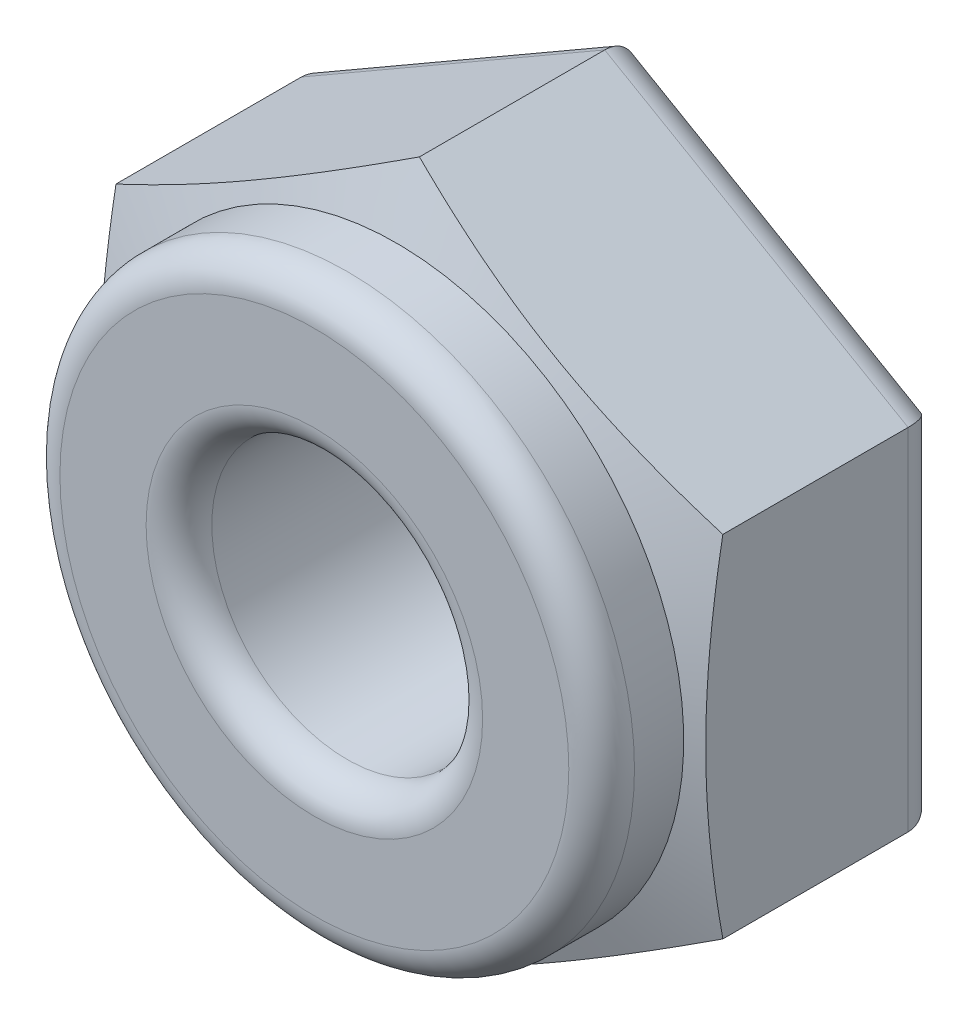
ISO-10303-21;
HEADER;
FILE_DESCRIPTION(('STEP AP214'),'2;1');
FILE_NAME('part.step','',(''),(''),'','','');
FILE_SCHEMA(('AUTOMOTIVE_DESIGN { 1 0 10303 214 1 1 1 1 }'));
ENDSEC;
DATA;
#1=APPLICATION_CONTEXT('core data for automotive mechanical design processes');
#2=APPLICATION_PROTOCOL_DEFINITION('international standard','automotive_design',2000,#1);
#3=PRODUCT_CONTEXT('',#1,'mechanical');
#4=PRODUCT('Part','Part','',(#3));
#5=PRODUCT_RELATED_PRODUCT_CATEGORY('part','',(#4));
#6=PRODUCT_DEFINITION_FORMATION('','',#4);
#7=PRODUCT_DEFINITION_CONTEXT('part definition',#1,'design');
#8=PRODUCT_DEFINITION('design','',#6,#7);
#9=PRODUCT_DEFINITION_SHAPE('','',#8);
#10=(LENGTH_UNIT() NAMED_UNIT(*) SI_UNIT(.MILLI.,.METRE.));
#11=(NAMED_UNIT(*) PLANE_ANGLE_UNIT() SI_UNIT($,.RADIAN.));
#12=(NAMED_UNIT(*) SI_UNIT($,.STERADIAN.) SOLID_ANGLE_UNIT());
#13=UNCERTAINTY_MEASURE_WITH_UNIT(LENGTH_MEASURE(1.E-05),#10,'distance_accuracy_value','');
#14=(GEOMETRIC_REPRESENTATION_CONTEXT(3) GLOBAL_UNCERTAINTY_ASSIGNED_CONTEXT((#13)) GLOBAL_UNIT_ASSIGNED_CONTEXT((#10,
#11,#12)) REPRESENTATION_CONTEXT('',''));
#15=CARTESIAN_POINT('',(0.,0.,0.));
#16=DIRECTION('',(0.,0.,1.));
#17=DIRECTION('',(1.,0.,0.));
#18=AXIS2_PLACEMENT_3D('',#15,#16,#17);
#19=CARTESIAN_POINT('',(0.,-2.33146835171283E-12,4.99999000000044));
#20=DIRECTION('',(0.,0.,-1.));
#21=DIRECTION('',(-1.,0.,0.));
#22=AXIS2_PLACEMENT_3D('',#19,#20,#21);
#23=CYLINDRICAL_SURFACE('',#22,4.44500000000129);
#24=CARTESIAN_POINT('',(2.05391259555748E-12,0.,3.72998999998253));
#25=DIRECTION('',(0.,0.,-1.));
#26=DIRECTION('',(-1.,0.,0.));
#27=AXIS2_PLACEMENT_3D('',#24,#25,#26);
#28=CIRCLE('',#27,4.44499999997766);
#29=CARTESIAN_POINT('',(-4.44499999997561,-1.01666730592746E-13,3.72998999998231));
#30=VERTEX_POINT('',#29);
#31=EDGE_CURVE('E309',#30,#30,#28,.T.);
#32=ORIENTED_EDGE('',*,*,#31,.F.);
#33=EDGE_LOOP('',(#32));
#34=FACE_BOUND('',#33,.T.);
#35=CARTESIAN_POINT('',(3.27515792264421E-12,5.55111512312578E-13,4.49199000000068));
#36=DIRECTION('',(0.,0.,1.));
#37=DIRECTION('',(1.,0.,0.));
#38=AXIS2_PLACEMENT_3D('',#35,#36,#37);
#39=CIRCLE('',#38,4.445);
#40=CARTESIAN_POINT('',(4.44500000000327,7.12289394133546E-13,4.4919900000009));
#41=VERTEX_POINT('',#40);
#42=EDGE_CURVE('E317',#41,#41,#39,.T.);
#43=ORIENTED_EDGE('',*,*,#42,.F.);
#44=EDGE_LOOP('',(#43));
#45=FACE_BOUND('',#44,.T.);
#46=ADVANCED_FACE('F18',(#34,#45),#23,.T.);
#47=CARTESIAN_POINT('',(3.27515792264421E-12,5.55111512312578E-13,4.49199000000068));
#48=DIRECTION('',(0.,0.,1.));
#49=DIRECTION('',(1.,0.,0.));
#50=AXIS2_PLACEMENT_3D('',#47,#48,#49);
#51=TOROIDAL_SURFACE('',#50,3.937,0.508);
#52=ORIENTED_EDGE('',*,*,#42,.T.);
#53=EDGE_LOOP('',(#52));
#54=FACE_BOUND('',#53,.T.);
#55=CARTESIAN_POINT('',(3.25036336734641E-12,5.56549695218678E-13,4.99999000000068));
#56=DIRECTION('',(0.,0.,-1.));
#57=DIRECTION('',(1.,0.,0.));
#58=AXIS2_PLACEMENT_3D('',#55,#56,#57);
#59=CIRCLE('',#58,3.93699999999893);
#60=CARTESIAN_POINT('',(-3.93699999999797,-1.00423854415712E-13,4.99999000000046));
#61=VERTEX_POINT('',#60);
#62=CARTESIAN_POINT('',(3.93700000000229,-4.59442828226769E-13,4.99999000000071));
#63=VERTEX_POINT('',#62);
#64=EDGE_CURVE('E124',#61,#63,#59,.F.);
#65=ORIENTED_EDGE('',*,*,#64,.F.);
#66=CARTESIAN_POINT('',(3.25036336734641E-12,5.56549695218678E-13,4.99999000000068));
#67=DIRECTION('',(0.,0.,-1.));
#68=DIRECTION('',(-1.,-6.84496563455178E-13,0.));
#69=AXIS2_PLACEMENT_3D('',#66,#67,#68);
#70=CIRCLE('',#69,3.93700000000164);
#71=EDGE_CURVE('E97',#63,#61,#70,.F.);
#72=ORIENTED_EDGE('',*,*,#71,.F.);
#73=EDGE_LOOP('',(#65,#72));
#74=FACE_BOUND('',#73,.T.);
#75=ADVANCED_FACE('F164',(#54,#74),#51,.T.);
#76=CARTESIAN_POINT('',(2.07125983031631E-12,0.,3.37250682844141));
#77=DIRECTION('',(0.,0.,-1.));
#78=DIRECTION('',(-1.,0.,0.));
#79=AXIS2_PLACEMENT_3D('',#76,#77,#78);
#80=CONICAL_SURFACE('',#79,5.42717694168212,1.22173047640878);
#81=CARTESIAN_POINT('',(9.77358803696029E-13,-5.42131902769296,3.37463893476826));
#82=CARTESIAN_POINT('',(0.194430301529192,-5.30906464076703,3.41550962808794));
#83=CARTESIAN_POINT('',(0.389501710334746,-5.19644011038195,3.45268845797098));
#84=CARTESIAN_POINT('',(0.78091278213935,-4.97045882271176,3.51809868629432));
#85=CARTESIAN_POINT('',(0.977253315522419,-4.85710156291021,3.54632308473285));
#86=CARTESIAN_POINT('',(1.36902392099205,-4.63091269838175,3.59197517919712));
#87=CARTESIAN_POINT('',(1.56444504779045,-4.51808625821935,3.60950244014097));
#88=CARTESIAN_POINT('',(1.95574424899372,-4.29216955907096,3.63301140707363));
#89=CARTESIAN_POINT('',(2.15162212449736,-4.17907941492065,3.63899744141869));
#90=CARTESIAN_POINT('',(2.54337787550463,-3.95289912662001,3.63899744141878));
#91=CARTESIAN_POINT('',(2.73925575100827,-3.8398089824697,3.63301140707382));
#92=CARTESIAN_POINT('',(3.13055495221155,-3.6138922833213,3.60950244014134));
#93=CARTESIAN_POINT('',(3.32597607900996,-3.5010658431589,3.59197517919758));
#94=CARTESIAN_POINT('',(3.71774668447961,-3.27487697863042,3.54632308473346));
#95=CARTESIAN_POINT('',(3.91408721786269,-3.16151971882887,3.51809868629502));
#96=CARTESIAN_POINT('',(4.30549828966731,-2.93553843115867,3.45268845797182));
#97=CARTESIAN_POINT('',(4.50056969847288,-2.82291390077358,3.41550962808885));
#98=CARTESIAN_POINT('',(4.6950000000011,-2.71065951384764,3.37463893476924));
#99=B_SPLINE_CURVE_WITH_KNOTS('',3,(#81,#82,#83,#84,#85,#86,#87,#88,#89,#90,#91,#92,#93,#94,#95,
#96,#97,#98),.UNSPECIFIED.,.F.,.F.,(4,2,2,2,2,2,2,2,4),(0.,0.684666414959032,1.36986674698595,
2.04858815775574,2.72705497514132,3.40552179252691,4.0842432032967,4.76944353532362,
5.45410995028266),.UNSPECIFIED.);
#100=CARTESIAN_POINT('',(0.,-5.42131902769253,3.37463893476842));
#101=VERTEX_POINT('',#100);
#102=CARTESIAN_POINT('',(4.69500000000178,-2.71065951384683,3.37463893476917));
#103=VERTEX_POINT('',#102);
#104=EDGE_CURVE('E179',#101,#103,#99,.T.);
#105=ORIENTED_EDGE('',*,*,#104,.T.);
#106=CARTESIAN_POINT('',(4.69500000000245,-2.71065951384603,3.37463893476911));
#107=CARTESIAN_POINT('',(4.69500000000286,-2.48615073999411,3.41550962808906));
#108=CARTESIAN_POINT('',(4.69500000000266,-2.26090167922388,3.45268845797194));
#109=CARTESIAN_POINT('',(4.69500000000226,-1.80893910388352,3.51809868629495));
#110=CARTESIAN_POINT('',(4.69500000000206,-1.58222458428049,3.5463230847333));
#111=CARTESIAN_POINT('',(4.69500000000288,-1.12984685522358,3.59197517919809));
#112=CARTESIAN_POINT('',(4.69500000000389,-0.904193974898762,3.60950244014261));
#113=CARTESIAN_POINT('',(4.69500000000107,-0.452360576601816,3.63301140707324));
#114=CARTESIAN_POINT('',(4.69499999999725,-0.226180288301049,3.63899744141559));
#115=CARTESIAN_POINT('',(4.69499999999726,0.226180288300474,3.6389974414156));
#116=CARTESIAN_POINT('',(4.69500000000109,0.452360576601231,3.63301140707326));
#117=CARTESIAN_POINT('',(4.69500000000391,0.904193974898157,3.60950244014265));
#118=CARTESIAN_POINT('',(4.69500000000291,1.12984685522297,3.59197517919813));
#119=CARTESIAN_POINT('',(4.69500000000211,1.58222458427985,3.54632308473336));
#120=CARTESIAN_POINT('',(4.69500000000231,1.80893910388288,3.51809868629502));
#121=CARTESIAN_POINT('',(4.69500000000273,2.26090167922322,3.45268845797203));
#122=CARTESIAN_POINT('',(4.69500000000294,2.48615073999344,3.41550962808916));
#123=CARTESIAN_POINT('',(4.69500000000253,2.71065951384535,3.37463893476921));
#124=B_SPLINE_CURVE_WITH_KNOTS('',3,(#106,#107,#108,#109,#110,#111,#112,#113,#114,#115,#116,
#117,#118,#119,#120,#121,#122,#123),.UNSPECIFIED.,.F.,.F.,(4,2,2,2,2,2,2,2,4),(0.,
0.684666414959181,1.36986674698589,2.04858815775578,2.72705497514164,3.40552179252747,
4.08424320329733,4.769443535324,5.45410995028315),.UNSPECIFIED.);
#125=CARTESIAN_POINT('',(4.69500000000157,2.71065951384619,3.37463893476936));
#126=VERTEX_POINT('',#125);
#127=EDGE_CURVE('E171',#103,#126,#124,.T.);
#128=ORIENTED_EDGE('',*,*,#127,.T.);
#129=CARTESIAN_POINT('',(4.6950000000006,2.71065951384703,3.37463893476952));
#130=CARTESIAN_POINT('',(4.5005696984724,2.82291390077294,3.41550962808913));
#131=CARTESIAN_POINT('',(4.30549828966687,2.935538431158,3.4526884579721));
#132=CARTESIAN_POINT('',(3.91408721786231,3.16151971882813,3.5180986862953));
#133=CARTESIAN_POINT('',(3.71774668447926,3.27487697862966,3.54632308473375));
#134=CARTESIAN_POINT('',(3.32597607900968,3.50106584315808,3.59197517919787));
#135=CARTESIAN_POINT('',(3.1305549522113,3.61389228332045,3.60950244014164));
#136=CARTESIAN_POINT('',(2.73925575100808,3.83980898246878,3.63301140707414));
#137=CARTESIAN_POINT('',(2.54337787550448,3.95289912661907,3.63899744141911));
#138=CARTESIAN_POINT('',(2.15162212449726,4.17907941491964,3.63899744141904));
#139=CARTESIAN_POINT('',(1.95574424899366,4.29216955906993,3.63301140707399));
#140=CARTESIAN_POINT('',(1.56444504779045,4.51808625821826,3.60950244014136));
#141=CARTESIAN_POINT('',(1.36902392099208,4.63091269838063,3.59197517919752));
#142=CARTESIAN_POINT('',(0.977253315522507,4.85710156290904,3.54632308473327));
#143=CARTESIAN_POINT('',(0.780912782139468,4.97045882271056,3.51809868629476));
#144=CARTESIAN_POINT('',(0.389501710334925,5.19644011038069,3.45268845797144));
#145=CARTESIAN_POINT('',(0.1944303015294,5.30906464076575,3.41550962808841));
#146=CARTESIAN_POINT('',(1.21646039087442E-12,5.42131902769166,3.37463893476875));
#147=B_SPLINE_CURVE_WITH_KNOTS('',3,(#129,#130,#131,#132,#133,#134,#135,#136,#137,#138,#139,
#140,#141,#142,#143,#144,#145,#146),.UNSPECIFIED.,.F.,.F.,(4,2,2,2,2,2,2,2,4),(0.,
0.684666414958911,1.36986674698571,2.04858815775538,2.72705497514084,3.4055217925263,
4.08424320329596,4.76944353532276,5.45410995028166),.UNSPECIFIED.);
#148=CARTESIAN_POINT('',(0.,5.42131902769152,3.3746389347688));
#149=VERTEX_POINT('',#148);
#150=EDGE_CURVE('E138',#126,#149,#147,.T.);
#151=ORIENTED_EDGE('',*,*,#150,.T.);
#152=CARTESIAN_POINT('',(-1.13361914529046E-12,5.42131902769138,3.37463893476885));
#153=CARTESIAN_POINT('',(-0.194430301529269,5.3090646407655,3.41550962808843));
#154=CARTESIAN_POINT('',(-0.389501710334744,5.19644011038046,3.45268845797138));
#155=CARTESIAN_POINT('',(-0.780912782139187,4.97045882271036,3.51809868629453));
#156=CARTESIAN_POINT('',(-0.977253315522173,4.85710156290886,3.54632308473297));
#157=CARTESIAN_POINT('',(-1.36902392099164,4.63091269838049,3.59197517919706));
#158=CARTESIAN_POINT('',(-1.56444504778996,4.51808625821814,3.60950244014081));
#159=CARTESIAN_POINT('',(-1.95574424899306,4.29216955906985,3.6330114070733));
#160=CARTESIAN_POINT('',(-2.15162212449661,4.17907941491959,3.63899744141827));
#161=CARTESIAN_POINT('',(-2.5433778755037,3.95289912661906,3.63899744141821));
#162=CARTESIAN_POINT('',(-2.73925575100725,3.8398089824688,3.63301140707317));
#163=CARTESIAN_POINT('',(-3.13055495221034,3.61389228332051,3.60950244014056));
#164=CARTESIAN_POINT('',(-3.32597607900866,3.50106584315816,3.59197517919675));
#165=CARTESIAN_POINT('',(-3.71774668447811,3.2748769786298,3.54632308473254));
#166=CARTESIAN_POINT('',(-3.91408721786109,3.1615197188283,3.51809868629405));
#167=CARTESIAN_POINT('',(-4.30549828966552,2.93553843115822,3.45268845797079));
#168=CARTESIAN_POINT('',(-4.50056969847099,2.82291390077318,3.4155096280878));
#169=CARTESIAN_POINT('',(-4.69499999999912,2.7106595138473,3.37463893476817));
#170=B_SPLINE_CURVE_WITH_KNOTS('',3,(#152,#153,#154,#155,#156,#157,#158,#159,#160,#161,#162,
#163,#164,#165,#166,#167,#168,#169),.UNSPECIFIED.,.F.,.F.,(4,2,2,2,2,2,2,2,4),(0.,
0.684666414958716,1.36986674698532,2.0485881577548,2.72705497514007,3.40552179252535,
4.08424320329483,4.76944353532142,5.45410995028014),.UNSPECIFIED.);
#171=CARTESIAN_POINT('',(-4.69499999999989,2.71065951384587,3.37463893476818));
#172=VERTEX_POINT('',#171);
#173=EDGE_CURVE('E129',#149,#172,#170,.T.);
#174=ORIENTED_EDGE('',*,*,#173,.T.);
#175=CARTESIAN_POINT('',(-4.69500000000013,2.71065951384475,3.37463893476831));
#176=CARTESIAN_POINT('',(-4.69500000000072,2.48615073999291,3.41550962808835));
#177=CARTESIAN_POINT('',(-4.69500000000043,2.26090167922275,3.45268845797113));
#178=CARTESIAN_POINT('',(-4.69499999999985,1.80893910388258,3.51809868629394));
#179=CARTESIAN_POINT('',(-4.69499999999956,1.58222458427967,3.54632308473219));
#180=CARTESIAN_POINT('',(-4.69500000000073,1.12984685522298,3.59197517919717));
#181=CARTESIAN_POINT('',(-4.69500000000217,0.904193974898241,3.60950244014197));
#182=CARTESIAN_POINT('',(-4.69499999999815,0.452360576601415,3.63301140707172));
#183=CARTESIAN_POINT('',(-4.69499999999268,0.226180288300685,3.63899744141291));
#184=CARTESIAN_POINT('',(-4.69499999999268,-0.226180288301027,3.6389974414129));
#185=CARTESIAN_POINT('',(-4.69499999999816,-0.45236057660201,3.6330114070717));
#186=CARTESIAN_POINT('',(-4.6950000000022,-0.904193974899341,3.60950244014189));
#187=CARTESIAN_POINT('',(-4.69500000000077,-1.12984685522433,3.59197517919704));
#188=CARTESIAN_POINT('',(-4.69499999999961,-1.58222458428153,3.54632308473196));
#189=CARTESIAN_POINT('',(-4.69499999999991,-1.80893910388469,3.51809868629364));
#190=CARTESIAN_POINT('',(-4.69500000000049,-2.26090167922536,3.4526884579707));
#191=CARTESIAN_POINT('',(-4.69500000000079,-2.48615073999577,3.41550962808784));
#192=CARTESIAN_POINT('',(-4.69500000000021,-2.71065951384786,3.37463893476772));
#193=B_SPLINE_CURVE_WITH_KNOTS('',3,(#175,#176,#177,#178,#179,#180,#181,#182,#183,#184,#185,
#186,#187,#188,#189,#190,#191,#192),.UNSPECIFIED.,.F.,.F.,(4,2,2,2,2,2,2,2,4),(0.,
0.684666414958953,1.36986674698527,2.04858815775493,2.72705497514062,3.40552179252708,
4.08424320329749,4.76944353532459,5.45410995028431),.UNSPECIFIED.);
#194=CARTESIAN_POINT('',(-4.69499999999892,-2.71065951384842,3.37463893476802));
#195=VERTEX_POINT('',#194);
#196=EDGE_CURVE('E115',#172,#195,#193,.T.);
#197=ORIENTED_EDGE('',*,*,#196,.T.);
#198=CARTESIAN_POINT('',(-4.69499999999763,-2.71065951384898,3.37463893476833));
#199=CARTESIAN_POINT('',(-4.50056969846956,-2.82291390077483,3.41550962808792));
#200=CARTESIAN_POINT('',(-4.30549828966414,-2.93553843115982,3.45268845797087));
#201=CARTESIAN_POINT('',(-3.91408721785981,-3.16151971882983,3.51809868629406));
#202=CARTESIAN_POINT('',(-3.71774668447689,-3.27487697863128,3.54632308473251));
#203=CARTESIAN_POINT('',(-3.32597607900754,-3.50106584315957,3.59197517919664));
#204=CARTESIAN_POINT('',(-3.13055495220927,-3.61389228332188,3.60950244014043));
#205=CARTESIAN_POINT('',(-2.73925575100629,-3.83980898247009,3.63301140707298));
#206=CARTESIAN_POINT('',(-2.54337787550279,-3.95289912662031,3.63899744141799));
#207=CARTESIAN_POINT('',(-2.1516221244958,-4.17907941492075,3.63899744141801));
#208=CARTESIAN_POINT('',(-1.95574424899231,-4.29216955907098,3.63301140707302));
#209=CARTESIAN_POINT('',(-1.56444504778931,-4.51808625821919,3.60950244014052));
#210=CARTESIAN_POINT('',(-1.36902392099105,-4.63091269838149,3.59197517919675));
#211=CARTESIAN_POINT('',(-0.977253315521696,-4.85710156290978,3.54632308473266));
#212=CARTESIAN_POINT('',(-0.780912782138766,-4.97045882271124,3.51809868629423));
#213=CARTESIAN_POINT('',(-0.389501710334434,-5.19644011038125,3.45268845797109));
#214=CARTESIAN_POINT('',(-0.194430301529014,-5.30906464076624,3.41550962808815));
#215=CARTESIAN_POINT('',(-9.32374946167448E-13,-5.42131902769209,3.37463893476858));
#216=B_SPLINE_CURVE_WITH_KNOTS('',3,(#198,#199,#200,#201,#202,#203,#204,#205,#206,#207,#208,
#209,#210,#211,#212,#213,#214,#215),.UNSPECIFIED.,.F.,.F.,(4,2,2,2,2,2,2,2,4),(0.,
0.684666414958509,1.3698667469849,2.04858815775418,2.72705497513925,3.40552179252433,
4.0842432032936,4.76944353532,5.45410995027851),.UNSPECIFIED.);
#217=EDGE_CURVE('E90',#195,#101,#216,.T.);
#218=ORIENTED_EDGE('',*,*,#217,.T.);
#219=EDGE_LOOP('',(#105,#128,#151,#174,#197,#218));
#220=FACE_BOUND('',#219,.T.);
#221=ORIENTED_EDGE('',*,*,#31,.T.);
#222=EDGE_LOOP('',(#221));
#223=FACE_BOUND('',#222,.T.);
#224=ADVANCED_FACE('F135',(#220,#223),#80,.T.);
#225=CARTESIAN_POINT('',(0.,-2.33146835171283E-12,4.99999000000044));
#226=DIRECTION('',(0.,0.,1.));
#227=DIRECTION('',(1.,0.,0.));
#228=AXIS2_PLACEMENT_3D('',#225,#226,#227);
#229=PLANE('',#228);
#230=ORIENTED_EDGE('',*,*,#71,.T.);
#231=ORIENTED_EDGE('',*,*,#64,.T.);
#232=EDGE_LOOP('',(#230,#231));
#233=FACE_BOUND('',#232,.T.);
#234=CARTESIAN_POINT('',(3.25036336734641E-12,5.56549695218678E-13,4.99999000000068));
#235=DIRECTION('',(0.,0.,1.));
#236=DIRECTION('',(-1.,-2.96362594046223E-13,0.));
#237=AXIS2_PLACEMENT_3D('',#234,#235,#236);
#238=CIRCLE('',#237,2.6035000000024);
#239=CARTESIAN_POINT('',(-2.60349999999792,3.28839697309287E-13,4.9999900000005));
#240=VERTEX_POINT('',#239);
#241=CARTESIAN_POINT('',(2.60350000000311,6.48611025999525E-13,4.99999000000067));
#242=VERTEX_POINT('',#241);
#243=EDGE_CURVE('E108',#240,#242,#238,.T.);
#244=ORIENTED_EDGE('',*,*,#243,.F.);
#245=CARTESIAN_POINT('',(3.25036336734641E-12,5.56549695218678E-13,4.99999000000068));
#246=DIRECTION('',(0.,0.,1.));
#247=DIRECTION('',(1.,0.,0.));
#248=AXIS2_PLACEMENT_3D('',#245,#246,#247);
#249=CIRCLE('',#248,2.60349999999911);
#250=EDGE_CURVE('E269',#242,#240,#249,.T.);
#251=ORIENTED_EDGE('',*,*,#250,.F.);
#252=EDGE_LOOP('',(#244,#251));
#253=FACE_BOUND('',#252,.T.);
#254=ADVANCED_FACE('F163',(#233,#253),#229,.T.);
#255=CARTESIAN_POINT('',(-4.69500000000013,2.71065951384336,3.72999000000336));
#256=DIRECTION('',(1.,0.,0.));
#257=DIRECTION('',(0.,1.,0.));
#258=AXIS2_PLACEMENT_3D('',#255,#256,#257);
#259=PLANE('',#258);
#260=DIRECTION('',(0.,-1.,0.));
#261=VECTOR('',#260,1.);
#262=CARTESIAN_POINT('',(-4.6949999999991,2.71065951384431,0.507999999999532));
#263=LINE('',#262,#261);
#264=CARTESIAN_POINT('',(-4.69500000000056,-2.71065951384784,0.508000000000503));
#265=VERTEX_POINT('',#264);
#266=CARTESIAN_POINT('',(-4.69499999999922,2.71065951384664,0.50800000000146));
#267=VERTEX_POINT('',#266);
#268=EDGE_CURVE('E249',#265,#267,#263,.F.);
#269=ORIENTED_EDGE('',*,*,#268,.F.);
#270=DIRECTION('',(0.,0.,1.));
#271=VECTOR('',#270,1.);
#272=CARTESIAN_POINT('',(-4.69500000000179,-2.71065951384659,3.72999000000096));
#273=LINE('',#272,#271);
#274=EDGE_CURVE('E121',#265,#195,#273,.T.);
#275=ORIENTED_EDGE('',*,*,#274,.T.);
#276=ORIENTED_EDGE('',*,*,#196,.F.);
#277=DIRECTION('',(0.,0.,1.));
#278=VECTOR('',#277,1.);
#279=CARTESIAN_POINT('',(-4.69499999999965,2.71065951384699,3.72999000000243));
#280=LINE('',#279,#278);
#281=EDGE_CURVE('E119',#172,#267,#280,.F.);
#282=ORIENTED_EDGE('',*,*,#281,.T.);
#283=EDGE_LOOP('',(#269,#275,#276,#282));
#284=FACE_BOUND('',#283,.T.);
#285=ADVANCED_FACE('F118',(#284),#259,.F.);
#286=CARTESIAN_POINT('',(-4.69499999999978,-2.71065951384775,3.72999000000096));
#287=DIRECTION('',(0.499999999999961,0.866025403784461,0.));
#288=DIRECTION('',(-0.866025403784461,0.499999999999961,0.));
#289=AXIS2_PLACEMENT_3D('',#286,#287,#288);
#290=PLANE('',#289);
#291=DIRECTION('',(0.866025403784461,-0.499999999999961,0.));
#292=VECTOR('',#291,1.);
#293=CARTESIAN_POINT('',(-4.69499999999997,-2.71065951384837,0.508000000001552));
#294=LINE('',#293,#292);
#295=CARTESIAN_POINT('',(-2.39601704739313E-12,-5.42131902769317,0.507999999999756));
#296=VERTEX_POINT('',#295);
#297=EDGE_CURVE('E332',#296,#265,#294,.F.);
#298=ORIENTED_EDGE('',*,*,#297,.F.);
#299=DIRECTION('',(0.,0.,1.));
#300=VECTOR('',#299,1.);
#301=CARTESIAN_POINT('',(-2.43217106879337E-12,-5.42131902769494,3.72999000000234));
#302=LINE('',#301,#300);
#303=EDGE_CURVE('E255',#296,#101,#302,.T.);
#304=ORIENTED_EDGE('',*,*,#303,.T.);
#305=ORIENTED_EDGE('',*,*,#217,.F.);
#306=ORIENTED_EDGE('',*,*,#274,.F.);
#307=EDGE_LOOP('',(#298,#304,#305,#306));
#308=FACE_BOUND('',#307,.T.);
#309=ADVANCED_FACE('F193',(#308),#290,.F.);
#310=CARTESIAN_POINT('',(-4.16333634234434E-13,-5.42131902769377,3.72999000000234));
#311=DIRECTION('',(-0.499999999999995,0.866025403784442,0.));
#312=DIRECTION('',(-0.866025403784442,-0.499999999999995,0.));
#313=AXIS2_PLACEMENT_3D('',#310,#311,#312);
#314=PLANE('',#313);
#315=DIRECTION('',(0.866025403784442,0.499999999999995,0.));
#316=VECTOR('',#315,1.);
#317=CARTESIAN_POINT('',(-1.06094603588569E-12,-5.42131902769181,0.507999999997941));
#318=LINE('',#317,#316);
#319=CARTESIAN_POINT('',(4.69500000000172,-2.7106595138457,0.507999999999468));
#320=VERTEX_POINT('',#319);
#321=EDGE_CURVE('E330',#320,#296,#318,.F.);
#322=ORIENTED_EDGE('',*,*,#321,.F.);
#323=DIRECTION('',(0.,0.,1.));
#324=VECTOR('',#323,1.);
#325=CARTESIAN_POINT('',(4.69500000000245,-2.7106595138463,3.72999000000097));
#326=LINE('',#325,#324);
#327=EDGE_CURVE('E252',#320,#103,#326,.T.);
#328=ORIENTED_EDGE('',*,*,#327,.T.);
#329=ORIENTED_EDGE('',*,*,#104,.F.);
#330=ORIENTED_EDGE('',*,*,#303,.F.);
#331=EDGE_LOOP('',(#322,#328,#329,#330));
#332=FACE_BOUND('',#331,.T.);
#333=ADVANCED_FACE('F196',(#332),#314,.F.);
#334=CARTESIAN_POINT('',(4.69500000000245,-2.71065951384664,3.72999000000097));
#335=DIRECTION('',(-1.,0.,0.));
#336=DIRECTION('',(0.,-1.,0.));
#337=AXIS2_PLACEMENT_3D('',#334,#335,#336);
#338=PLANE('',#337);
#339=DIRECTION('',(0.,1.,0.));
#340=VECTOR('',#339,1.);
#341=CARTESIAN_POINT('',(4.69500000000149,-2.71065951384814,0.508000000000926));
#342=LINE('',#341,#340);
#343=CARTESIAN_POINT('',(4.69500000000079,2.71065951384702,0.508000000000082));
#344=VERTEX_POINT('',#343);
#345=EDGE_CURVE('E328',#344,#320,#342,.F.);
#346=ORIENTED_EDGE('',*,*,#345,.F.);
#347=DIRECTION('',(0.,0.,1.));
#348=VECTOR('',#347,1.);
#349=CARTESIAN_POINT('',(4.69499999999997,2.71065951384738,3.72999000000281));
#350=LINE('',#349,#348);
#351=EDGE_CURVE('E140',#344,#126,#350,.T.);
#352=ORIENTED_EDGE('',*,*,#351,.T.);
#353=ORIENTED_EDGE('',*,*,#127,.F.);
#354=ORIENTED_EDGE('',*,*,#327,.F.);
#355=EDGE_LOOP('',(#346,#352,#353,#354));
#356=FACE_BOUND('',#355,.T.);
#357=ADVANCED_FACE('F378',(#356),#338,.F.);
#358=CARTESIAN_POINT('',(4.69500000000203,2.71065951384619,3.72999000000281));
#359=DIRECTION('',(-0.499999999999958,-0.866025403784463,0.));
#360=DIRECTION('',(0.866025403784463,-0.499999999999958,0.));
#361=AXIS2_PLACEMENT_3D('',#358,#359,#360);
#362=PLANE('',#361);
#363=DIRECTION('',(-0.866025403784463,0.499999999999958,0.));
#364=VECTOR('',#363,1.);
#365=CARTESIAN_POINT('',(4.6950000000031,2.71065951384571,0.508000000000939));
#366=LINE('',#365,#364);
#367=CARTESIAN_POINT('',(2.33156549587219E-13,5.4213190276914,0.508000000002197));
#368=VERTEX_POINT('',#367);
#369=EDGE_CURVE('E325',#368,#344,#366,.F.);
#370=ORIENTED_EDGE('',*,*,#369,.F.);
#371=DIRECTION('',(0.,0.,1.));
#372=VECTOR('',#371,1.);
#373=CARTESIAN_POINT('',(-1.02637347679685E-12,5.42131902769144,3.72999000000243));
#374=LINE('',#373,#372);
#375=EDGE_CURVE('E132',#368,#149,#374,.T.);
#376=ORIENTED_EDGE('',*,*,#375,.T.);
#377=ORIENTED_EDGE('',*,*,#150,.F.);
#378=ORIENTED_EDGE('',*,*,#351,.F.);
#379=EDGE_LOOP('',(#370,#376,#377,#378));
#380=FACE_BOUND('',#379,.T.);
#381=ADVANCED_FACE('F368',(#380),#362,.F.);
#382=CARTESIAN_POINT('',(0.,5.42131902769205,3.72999000000243));
#383=DIRECTION('',(0.499999999999994,-0.866025403784442,0.));
#384=DIRECTION('',(0.866025403784442,0.499999999999994,0.));
#385=AXIS2_PLACEMENT_3D('',#382,#383,#384);
#386=PLANE('',#385);
#387=DIRECTION('',(-0.866025403784442,-0.499999999999994,0.));
#388=VECTOR('',#387,1.);
#389=CARTESIAN_POINT('',(1.75532331725403E-13,5.42131902769108,0.508000000003442));
#390=LINE('',#389,#388);
#391=EDGE_CURVE('E131',#267,#368,#390,.F.);
#392=ORIENTED_EDGE('',*,*,#391,.F.);
#393=ORIENTED_EDGE('',*,*,#281,.F.);
#394=ORIENTED_EDGE('',*,*,#173,.F.);
#395=ORIENTED_EDGE('',*,*,#375,.F.);
#396=EDGE_LOOP('',(#392,#393,#394,#395));
#397=FACE_BOUND('',#396,.T.);
#398=ADVANCED_FACE('F127',(#397),#386,.F.);
#399=CARTESIAN_POINT('',(3.27515792264421E-12,5.55111512312578E-13,4.49199000000068));
#400=DIRECTION('',(0.,0.,1.));
#401=DIRECTION('',(1.,0.,0.));
#402=AXIS2_PLACEMENT_3D('',#399,#400,#401);
#403=TOROIDAL_SURFACE('',#402,2.6035,0.508);
#404=CARTESIAN_POINT('',(-2.19245855220889E-13,0.,4.49199000000068));
#405=DIRECTION('',(0.,0.,1.));
#406=DIRECTION('',(1.,0.,0.));
#407=AXIS2_PLACEMENT_3D('',#404,#405,#406);
#408=CIRCLE('',#407,2.09550000000061);
#409=CARTESIAN_POINT('',(2.09550000000039,0.,4.49199000000078));
#410=VERTEX_POINT('',#409);
#411=EDGE_CURVE('E321',#410,#410,#408,.F.);
#412=ORIENTED_EDGE('',*,*,#411,.T.);
#413=EDGE_LOOP('',(#412));
#414=FACE_BOUND('',#413,.T.);
#415=ORIENTED_EDGE('',*,*,#250,.T.);
#416=ORIENTED_EDGE('',*,*,#243,.T.);
#417=EDGE_LOOP('',(#415,#416));
#418=FACE_BOUND('',#417,.T.);
#419=ADVANCED_FACE('F238',(#414,#418),#403,.T.);
#420=CARTESIAN_POINT('',(-4.18699999999896,2.7106595138443,0.508000000001778));
#421=DIRECTION('',(0.,-1.,0.));
#422=DIRECTION('',(1.,0.,0.));
#423=AXIS2_PLACEMENT_3D('',#420,#421,#422);
#424=CYLINDRICAL_SURFACE('',#423,0.508000000000145);
#425=CARTESIAN_POINT('',(-4.18699999999896,2.41736557709788,0.508000000002062));
#426=DIRECTION('',(-0.50000000000001,-0.866025403784433,0.));
#427=DIRECTION('',(-0.866025403784433,0.50000000000001,0.));
#428=AXIS2_PLACEMENT_3D('',#425,#426,#427);
#429=ELLIPSE('',#428,0.586587873496804,0.508000000000126);
#430=CARTESIAN_POINT('',(-4.18699999999525,2.4173655770949,2.27930635064891E-13));
#431=VERTEX_POINT('',#430);
#432=EDGE_CURVE('E322',#431,#267,#429,.F.);
#433=ORIENTED_EDGE('',*,*,#432,.F.);
#434=DIRECTION('',(0.,1.,0.));
#435=VECTOR('',#434,1.);
#436=CARTESIAN_POINT('',(-4.18699999999597,-5.42131902769305,2.50153828207419E-13));
#437=LINE('',#436,#435);
#438=CARTESIAN_POINT('',(-4.18699999999677,-2.41736557709909,2.41668664247019E-13));
#439=VERTEX_POINT('',#438);
#440=EDGE_CURVE('E345',#431,#439,#437,.F.);
#441=ORIENTED_EDGE('',*,*,#440,.T.);
#442=CARTESIAN_POINT('',(-4.18699999999903,-2.4173655771004,0.508000000000943));
#443=DIRECTION('',(0.500000000000013,-0.866025403784431,0.));
#444=DIRECTION('',(0.866025403784431,0.500000000000013,0.));
#445=AXIS2_PLACEMENT_3D('',#442,#443,#444);
#446=ELLIPSE('',#445,0.586587873496836,0.508000000000144);
#447=EDGE_CURVE('E151',#265,#439,#446,.T.);
#448=ORIENTED_EDGE('',*,*,#447,.F.);
#449=ORIENTED_EDGE('',*,*,#268,.T.);
#450=EDGE_LOOP('',(#433,#441,#448,#449));
#451=FACE_BOUND('',#450,.T.);
#452=ADVANCED_FACE('F235',(#451),#424,.T.);
#453=CARTESIAN_POINT('',(-4.44099999999992,-2.27071860872574,0.508000000000182));
#454=DIRECTION('',(0.866025403784461,-0.499999999999961,0.));
#455=DIRECTION('',(0.499999999999961,0.866025403784461,0.));
#456=AXIS2_PLACEMENT_3D('',#453,#454,#455);
#457=CYLINDRICAL_SURFACE('',#456,0.508000000000142);
#458=CARTESIAN_POINT('',(-1.86089750379981E-12,-4.83473115419548,0.508000000000439));
#459=DIRECTION('',(1.,0.,0.));
#460=DIRECTION('',(0.,1.,0.));
#461=AXIS2_PLACEMENT_3D('',#458,#459,#460);
#462=ELLIPSE('',#461,0.586587873496798,0.508000000000127);
#463=CARTESIAN_POINT('',(-7.06327390181169E-13,-4.8347311541973,2.8285116314286E-13));
#464=VERTEX_POINT('',#463);
#465=EDGE_CURVE('E331',#296,#464,#462,.T.);
#466=ORIENTED_EDGE('',*,*,#465,.F.);
#467=ORIENTED_EDGE('',*,*,#297,.T.);
#468=ORIENTED_EDGE('',*,*,#447,.T.);
#469=DIRECTION('',(0.866025403784206,-0.500000000000403,0.));
#470=VECTOR('',#469,1.);
#471=CARTESIAN_POINT('',(-4.18699999999943,-2.41736557709848,2.41649429578717E-13));
#472=LINE('',#471,#470);
#473=EDGE_CURVE('E342',#439,#464,#472,.T.);
#474=ORIENTED_EDGE('',*,*,#473,.T.);
#475=EDGE_LOOP('',(#466,#467,#468,#474));
#476=FACE_BOUND('',#475,.T.);
#477=ADVANCED_FACE('F231',(#476),#457,.T.);
#478=CARTESIAN_POINT('',(-0.254000000001114,-4.98137812256921,0.508000000000675));
#479=DIRECTION('',(0.866025403784442,0.499999999999995,0.));
#480=DIRECTION('',(-0.499999999999995,0.866025403784442,0.));
#481=AXIS2_PLACEMENT_3D('',#478,#479,#480);
#482=CYLINDRICAL_SURFACE('',#481,0.508000000000112);
#483=CARTESIAN_POINT('',(4.18700000000135,-2.4173655770967,0.507999999999436));
#484=DIRECTION('',(0.500000000000009,0.866025403784433,0.));
#485=DIRECTION('',(-0.866025403784433,0.500000000000009,0.));
#486=AXIS2_PLACEMENT_3D('',#483,#484,#485);
#487=ELLIPSE('',#486,0.586587873496807,0.508000000000129);
#488=CARTESIAN_POINT('',(4.1870000000027,-2.4173655770973,3.10369077633486E-13));
#489=VERTEX_POINT('',#488);
#490=EDGE_CURVE('E329',#320,#489,#487,.T.);
#491=ORIENTED_EDGE('',*,*,#490,.F.);
#492=ORIENTED_EDGE('',*,*,#321,.T.);
#493=ORIENTED_EDGE('',*,*,#465,.T.);
#494=DIRECTION('',(0.866025403784223,0.500000000000373,0.));
#495=VECTOR('',#494,1.);
#496=CARTESIAN_POINT('',(4.44089209850068E-13,-4.83473115419797,2.82833979484253E-13));
#497=LINE('',#496,#495);
#498=EDGE_CURVE('E344',#464,#489,#497,.T.);
#499=ORIENTED_EDGE('',*,*,#498,.T.);
#500=EDGE_LOOP('',(#491,#492,#493,#499));
#501=FACE_BOUND('',#500,.T.);
#502=ADVANCED_FACE('F227',(#501),#482,.T.);
#503=CARTESIAN_POINT('',(4.18700000000134,-2.71065951384813,0.507999999998128));
#504=DIRECTION('',(0.,1.,0.));
#505=DIRECTION('',(-1.,0.,0.));
#506=AXIS2_PLACEMENT_3D('',#503,#504,#505);
#507=CYLINDRICAL_SURFACE('',#506,0.508000000000145);
#508=CARTESIAN_POINT('',(4.18700000000142,2.41736557709817,0.507999999999217));
#509=DIRECTION('',(-0.500000000000015,0.86602540378443,0.));
#510=DIRECTION('',(-0.86602540378443,-0.500000000000015,0.));
#511=AXIS2_PLACEMENT_3D('',#508,#509,#510);
#512=ELLIPSE('',#511,0.586587873496835,0.508000000000143);
#513=CARTESIAN_POINT('',(4.18700000000288,2.41736557709904,2.9664066578549E-13));
#514=VERTEX_POINT('',#513);
#515=EDGE_CURVE('E326',#344,#514,#512,.T.);
#516=ORIENTED_EDGE('',*,*,#515,.F.);
#517=ORIENTED_EDGE('',*,*,#345,.T.);
#518=ORIENTED_EDGE('',*,*,#490,.T.);
#519=DIRECTION('',(0.,1.,0.));
#520=VECTOR('',#519,1.);
#521=CARTESIAN_POINT('',(4.18700000000285,-5.42131902769305,3.1883547191305E-13));
#522=LINE('',#521,#520);
#523=EDGE_CURVE('E348',#489,#514,#522,.T.);
#524=ORIENTED_EDGE('',*,*,#523,.T.);
#525=EDGE_LOOP('',(#516,#517,#518,#524));
#526=FACE_BOUND('',#525,.T.);
#527=ADVANCED_FACE('F223',(#526),#507,.T.);
#528=CARTESIAN_POINT('',(4.44100000000305,2.27071860872308,0.50800000000023));
#529=DIRECTION('',(-0.866025403784463,0.499999999999958,0.));
#530=DIRECTION('',(-0.499999999999958,-0.866025403784463,0.));
#531=AXIS2_PLACEMENT_3D('',#528,#529,#530);
#532=CYLINDRICAL_SURFACE('',#531,0.50800000000014);
#533=CARTESIAN_POINT('',(1.28122881228043E-12,4.83473115419494,0.508000000001321));
#534=DIRECTION('',(-1.,0.,0.));
#535=DIRECTION('',(0.,-1.,0.));
#536=AXIS2_PLACEMENT_3D('',#533,#534,#535);
#537=ELLIPSE('',#536,0.586587873496794,0.508000000000124);
#538=CARTESIAN_POINT('',(6.83548812170647E-13,4.83473115419457,2.55448549555491E-13));
#539=VERTEX_POINT('',#538);
#540=EDGE_CURVE('E37',#368,#539,#537,.T.);
#541=ORIENTED_EDGE('',*,*,#540,.F.);
#542=ORIENTED_EDGE('',*,*,#369,.T.);
#543=ORIENTED_EDGE('',*,*,#515,.T.);
#544=DIRECTION('',(-0.866025403784681,0.499999999999581,0.));
#545=VECTOR('',#544,1.);
#546=CARTESIAN_POINT('',(4.18700000000413,2.41736557709832,2.9664361717896E-13));
#547=LINE('',#546,#545);
#548=EDGE_CURVE('E353',#514,#539,#547,.T.);
#549=ORIENTED_EDGE('',*,*,#548,.T.);
#550=EDGE_LOOP('',(#541,#542,#543,#549));
#551=FACE_BOUND('',#550,.T.);
#552=ADVANCED_FACE('F220',(#551),#532,.T.);
#553=CARTESIAN_POINT('',(0.254000000000226,4.98137812256849,0.508000000002402));
#554=DIRECTION('',(-0.866025403784442,-0.499999999999994,0.));
#555=DIRECTION('',(0.499999999999994,-0.866025403784442,0.));
#556=AXIS2_PLACEMENT_3D('',#553,#554,#555);
#557=CYLINDRICAL_SURFACE('',#556,0.508000000000108);
#558=ORIENTED_EDGE('',*,*,#540,.T.);
#559=DIRECTION('',(-0.866025403783924,-0.500000000000891,0.));
#560=VECTOR('',#559,1.);
#561=CARTESIAN_POINT('',(0.,4.83473115419492,2.55459067273398E-13));
#562=LINE('',#561,#560);
#563=EDGE_CURVE('E28',#539,#431,#562,.T.);
#564=ORIENTED_EDGE('',*,*,#563,.T.);
#565=ORIENTED_EDGE('',*,*,#432,.T.);
#566=ORIENTED_EDGE('',*,*,#391,.T.);
#567=EDGE_LOOP('',(#558,#564,#565,#566));
#568=FACE_BOUND('',#567,.T.);
#569=ADVANCED_FACE('F212',(#568),#557,.T.);
#570=CARTESIAN_POINT('',(0.,0.,0.));
#571=DIRECTION('',(0.,0.,1.));
#572=DIRECTION('',(1.,0.,0.));
#573=AXIS2_PLACEMENT_3D('',#570,#571,#572);
#574=CYLINDRICAL_SURFACE('',#573,2.09550000000061);
#575=CARTESIAN_POINT('',(0.,0.,0.));
#576=DIRECTION('',(0.,0.,1.));
#577=DIRECTION('',(1.,0.,0.));
#578=AXIS2_PLACEMENT_3D('',#575,#576,#577);
#579=CIRCLE('',#578,2.09550000000061);
#580=CARTESIAN_POINT('',(2.09550000000061,0.,1.02277540603524E-13));
#581=VERTEX_POINT('',#580);
#582=EDGE_CURVE('E11',#581,#581,#579,.F.);
#583=ORIENTED_EDGE('',*,*,#582,.T.);
#584=EDGE_LOOP('',(#583));
#585=FACE_BOUND('',#584,.T.);
#586=ORIENTED_EDGE('',*,*,#411,.F.);
#587=EDGE_LOOP('',(#586));
#588=FACE_BOUND('',#587,.T.);
#589=ADVANCED_FACE('F206',(#585,#588),#574,.F.);
#590=CARTESIAN_POINT('',(-1.23512311489549E-12,-5.42131902769305,2.84494650060196E-13));
#591=DIRECTION('',(0.,0.,1.));
#592=DIRECTION('',(1.,0.,0.));
#593=AXIS2_PLACEMENT_3D('',#590,#591,#592);
#594=PLANE('',#593);
#595=ORIENTED_EDGE('',*,*,#582,.F.);
#596=EDGE_LOOP('',(#595));
#597=FACE_BOUND('',#596,.T.);
#598=ORIENTED_EDGE('',*,*,#548,.F.);
#599=ORIENTED_EDGE('',*,*,#523,.F.);
#600=ORIENTED_EDGE('',*,*,#498,.F.);
#601=ORIENTED_EDGE('',*,*,#473,.F.);
#602=ORIENTED_EDGE('',*,*,#440,.F.);
#603=ORIENTED_EDGE('',*,*,#563,.F.);
#604=EDGE_LOOP('',(#598,#599,#600,#601,#602,#603));
#605=FACE_BOUND('',#604,.T.);
#606=ADVANCED_FACE('F204',(#597,#605),#594,.F.);
#607=CLOSED_SHELL('',(#46,#75,#224,#254,#285,#309,#333,#357,#381,#398,#419,#452,#477,#502,#527,
#552,#569,#589,#606));
#608=MANIFOLD_SOLID_BREP('B1',#607);
#609=ADVANCED_BREP_SHAPE_REPRESENTATION('',(#18,#608),#14);
#610=SHAPE_DEFINITION_REPRESENTATION(#9,#609);
ENDSEC;
END-ISO-10303-21;
